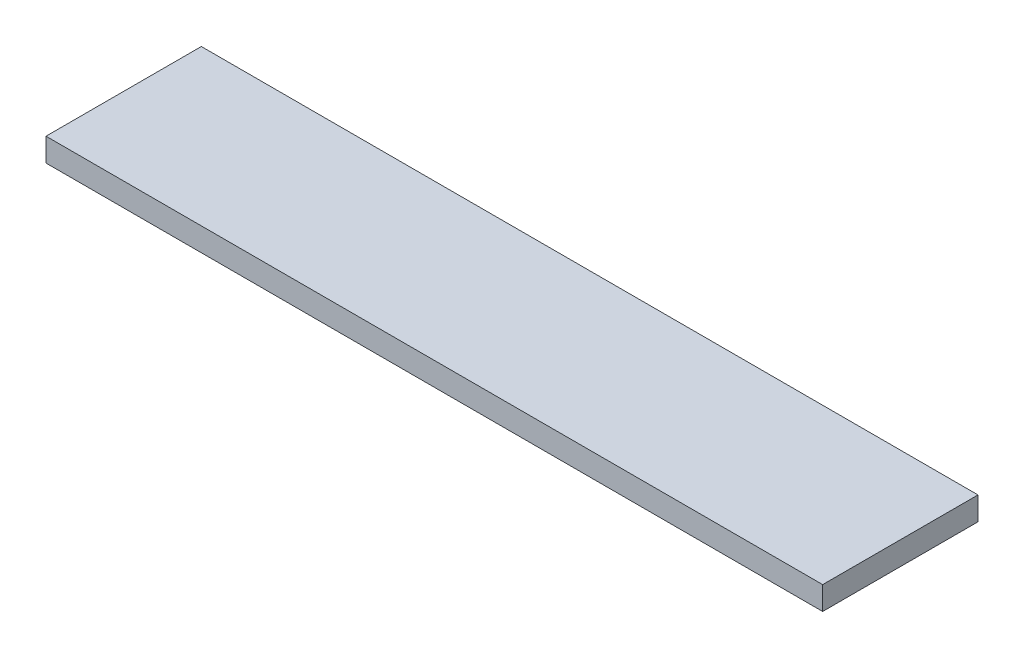
ISO-10303-21;
HEADER;
FILE_DESCRIPTION(('STEP AP214'),'2;1');
FILE_NAME('part.step','',(''),(''),'','','');
FILE_SCHEMA(('AUTOMOTIVE_DESIGN { 1 0 10303 214 1 1 1 1 }'));
ENDSEC;
DATA;
#1=APPLICATION_CONTEXT('core data for automotive mechanical design processes');
#2=APPLICATION_PROTOCOL_DEFINITION('international standard','automotive_design',2000,#1);
#3=PRODUCT_CONTEXT('',#1,'mechanical');
#4=PRODUCT('Part','Part','',(#3));
#5=PRODUCT_RELATED_PRODUCT_CATEGORY('part','',(#4));
#6=PRODUCT_DEFINITION_FORMATION('','',#4);
#7=PRODUCT_DEFINITION_CONTEXT('part definition',#1,'design');
#8=PRODUCT_DEFINITION('design','',#6,#7);
#9=PRODUCT_DEFINITION_SHAPE('','',#8);
#10=(LENGTH_UNIT() NAMED_UNIT(*) SI_UNIT(.MILLI.,.METRE.));
#11=(NAMED_UNIT(*) PLANE_ANGLE_UNIT() SI_UNIT($,.RADIAN.));
#12=(NAMED_UNIT(*) SI_UNIT($,.STERADIAN.) SOLID_ANGLE_UNIT());
#13=UNCERTAINTY_MEASURE_WITH_UNIT(LENGTH_MEASURE(1.E-05),#10,'distance_accuracy_value','');
#14=(GEOMETRIC_REPRESENTATION_CONTEXT(3) GLOBAL_UNCERTAINTY_ASSIGNED_CONTEXT((#13)) GLOBAL_UNIT_ASSIGNED_CONTEXT((#10,
#11,#12)) REPRESENTATION_CONTEXT('',''));
#15=CARTESIAN_POINT('',(0.,0.,0.));
#16=DIRECTION('',(0.,0.,1.));
#17=DIRECTION('',(1.,0.,0.));
#18=AXIS2_PLACEMENT_3D('',#15,#16,#17);
#19=CARTESIAN_POINT('',(100.,0.,0.));
#20=DIRECTION('',(0.,0.,-1.));
#21=DIRECTION('',(-1.,0.,0.));
#22=AXIS2_PLACEMENT_3D('',#19,#20,#21);
#23=PLANE('',#22);
#24=DIRECTION('',(0.,-1.,0.));
#25=VECTOR('',#24,1.);
#26=CARTESIAN_POINT('',(0.,0.,0.));
#27=LINE('',#26,#25);
#28=CARTESIAN_POINT('',(0.,3.,0.));
#29=VERTEX_POINT('',#28);
#30=CARTESIAN_POINT('',(0.,0.,0.));
#31=VERTEX_POINT('',#30);
#32=EDGE_CURVE('E98',#29,#31,#27,.T.);
#33=ORIENTED_EDGE('',*,*,#32,.T.);
#34=DIRECTION('',(-1.,0.,0.));
#35=VECTOR('',#34,1.);
#36=CARTESIAN_POINT('',(100.,0.,0.));
#37=LINE('',#36,#35);
#38=CARTESIAN_POINT('',(100.,0.,0.));
#39=VERTEX_POINT('',#38);
#40=EDGE_CURVE('E11',#39,#31,#37,.T.);
#41=ORIENTED_EDGE('',*,*,#40,.F.);
#42=DIRECTION('',(0.,-1.,0.));
#43=VECTOR('',#42,1.);
#44=CARTESIAN_POINT('',(100.,0.,0.));
#45=LINE('',#44,#43);
#46=CARTESIAN_POINT('',(100.,3.,0.));
#47=VERTEX_POINT('',#46);
#48=EDGE_CURVE('E86',#47,#39,#45,.T.);
#49=ORIENTED_EDGE('',*,*,#48,.F.);
#50=DIRECTION('',(-1.,0.,0.));
#51=VECTOR('',#50,1.);
#52=CARTESIAN_POINT('',(100.,3.,0.));
#53=LINE('',#52,#51);
#54=EDGE_CURVE('E94',#47,#29,#53,.T.);
#55=ORIENTED_EDGE('',*,*,#54,.T.);
#56=EDGE_LOOP('',(#33,#41,#49,#55));
#57=FACE_BOUND('',#56,.T.);
#58=ADVANCED_FACE('F35',(#57),#23,.F.);
#59=CARTESIAN_POINT('',(100.,0.,0.));
#60=DIRECTION('',(0.,1.,0.));
#61=DIRECTION('',(0.,0.,1.));
#62=AXIS2_PLACEMENT_3D('',#59,#60,#61);
#63=PLANE('',#62);
#64=DIRECTION('',(0.,0.,-1.));
#65=VECTOR('',#64,1.);
#66=CARTESIAN_POINT('',(0.,0.,0.));
#67=LINE('',#66,#65);
#68=CARTESIAN_POINT('',(0.,0.,-20.));
#69=VERTEX_POINT('',#68);
#70=EDGE_CURVE('E90',#31,#69,#67,.T.);
#71=ORIENTED_EDGE('',*,*,#70,.T.);
#72=DIRECTION('',(-1.,0.,0.));
#73=VECTOR('',#72,1.);
#74=CARTESIAN_POINT('',(100.,0.,-20.));
#75=LINE('',#74,#73);
#76=CARTESIAN_POINT('',(100.,0.,-20.));
#77=VERTEX_POINT('',#76);
#78=EDGE_CURVE('E43',#77,#69,#75,.T.);
#79=ORIENTED_EDGE('',*,*,#78,.F.);
#80=DIRECTION('',(0.,0.,-1.));
#81=VECTOR('',#80,1.);
#82=CARTESIAN_POINT('',(100.,0.,0.));
#83=LINE('',#82,#81);
#84=EDGE_CURVE('E81',#39,#77,#83,.T.);
#85=ORIENTED_EDGE('',*,*,#84,.F.);
#86=ORIENTED_EDGE('',*,*,#40,.T.);
#87=EDGE_LOOP('',(#71,#79,#85,#86));
#88=FACE_BOUND('',#87,.T.);
#89=ADVANCED_FACE('F89',(#88),#63,.F.);
#90=CARTESIAN_POINT('',(100.,0.,-20.));
#91=DIRECTION('',(0.,0.,1.));
#92=DIRECTION('',(1.,0.,0.));
#93=AXIS2_PLACEMENT_3D('',#90,#91,#92);
#94=PLANE('',#93);
#95=DIRECTION('',(0.,1.,0.));
#96=VECTOR('',#95,1.);
#97=CARTESIAN_POINT('',(0.,0.,-20.));
#98=LINE('',#97,#96);
#99=CARTESIAN_POINT('',(0.,3.,-20.));
#100=VERTEX_POINT('',#99);
#101=EDGE_CURVE('E68',#69,#100,#98,.T.);
#102=ORIENTED_EDGE('',*,*,#101,.T.);
#103=DIRECTION('',(-1.,0.,0.));
#104=VECTOR('',#103,1.);
#105=CARTESIAN_POINT('',(100.,3.,-20.));
#106=LINE('',#105,#104);
#107=CARTESIAN_POINT('',(100.,3.,-20.));
#108=VERTEX_POINT('',#107);
#109=EDGE_CURVE('E91',#108,#100,#106,.T.);
#110=ORIENTED_EDGE('',*,*,#109,.F.);
#111=DIRECTION('',(0.,1.,0.));
#112=VECTOR('',#111,1.);
#113=CARTESIAN_POINT('',(100.,0.,-20.));
#114=LINE('',#113,#112);
#115=EDGE_CURVE('E84',#77,#108,#114,.T.);
#116=ORIENTED_EDGE('',*,*,#115,.F.);
#117=ORIENTED_EDGE('',*,*,#78,.T.);
#118=EDGE_LOOP('',(#102,#110,#116,#117));
#119=FACE_BOUND('',#118,.T.);
#120=ADVANCED_FACE('F92',(#119),#94,.F.);
#121=CARTESIAN_POINT('',(100.,3.,0.));
#122=DIRECTION('',(0.,-1.,0.));
#123=DIRECTION('',(0.,0.,-1.));
#124=AXIS2_PLACEMENT_3D('',#121,#122,#123);
#125=PLANE('',#124);
#126=DIRECTION('',(0.,0.,1.));
#127=VECTOR('',#126,1.);
#128=CARTESIAN_POINT('',(0.,3.,0.));
#129=LINE('',#128,#127);
#130=EDGE_CURVE('E74',#100,#29,#129,.T.);
#131=ORIENTED_EDGE('',*,*,#130,.T.);
#132=ORIENTED_EDGE('',*,*,#54,.F.);
#133=DIRECTION('',(0.,0.,1.));
#134=VECTOR('',#133,1.);
#135=CARTESIAN_POINT('',(100.,3.,0.));
#136=LINE('',#135,#134);
#137=EDGE_CURVE('E51',#108,#47,#136,.T.);
#138=ORIENTED_EDGE('',*,*,#137,.F.);
#139=ORIENTED_EDGE('',*,*,#109,.T.);
#140=EDGE_LOOP('',(#131,#132,#138,#139));
#141=FACE_BOUND('',#140,.T.);
#142=ADVANCED_FACE('F105',(#141),#125,.F.);
#143=CARTESIAN_POINT('',(100.,0.,0.));
#144=DIRECTION('',(-1.,0.,0.));
#145=DIRECTION('',(0.,0.,1.));
#146=AXIS2_PLACEMENT_3D('',#143,#144,#145);
#147=PLANE('',#146);
#148=ORIENTED_EDGE('',*,*,#48,.T.);
#149=ORIENTED_EDGE('',*,*,#84,.T.);
#150=ORIENTED_EDGE('',*,*,#115,.T.);
#151=ORIENTED_EDGE('',*,*,#137,.T.);
#152=EDGE_LOOP('',(#148,#149,#150,#151));
#153=FACE_BOUND('',#152,.T.);
#154=ADVANCED_FACE('F82',(#153),#147,.F.);
#155=CARTESIAN_POINT('',(0.,0.,0.));
#156=DIRECTION('',(-1.,0.,0.));
#157=DIRECTION('',(0.,0.,1.));
#158=AXIS2_PLACEMENT_3D('',#155,#156,#157);
#159=PLANE('',#158);
#160=ORIENTED_EDGE('',*,*,#32,.F.);
#161=ORIENTED_EDGE('',*,*,#130,.F.);
#162=ORIENTED_EDGE('',*,*,#101,.F.);
#163=ORIENTED_EDGE('',*,*,#70,.F.);
#164=EDGE_LOOP('',(#160,#161,#162,#163));
#165=FACE_BOUND('',#164,.T.);
#166=ADVANCED_FACE('F108',(#165),#159,.T.);
#167=CLOSED_SHELL('',(#58,#89,#120,#142,#154,#166));
#168=MANIFOLD_SOLID_BREP('B2',#167);
#169=ADVANCED_BREP_SHAPE_REPRESENTATION('',(#18,#168),#14);
#170=SHAPE_DEFINITION_REPRESENTATION(#9,#169);
ENDSEC;
END-ISO-10303-21;
